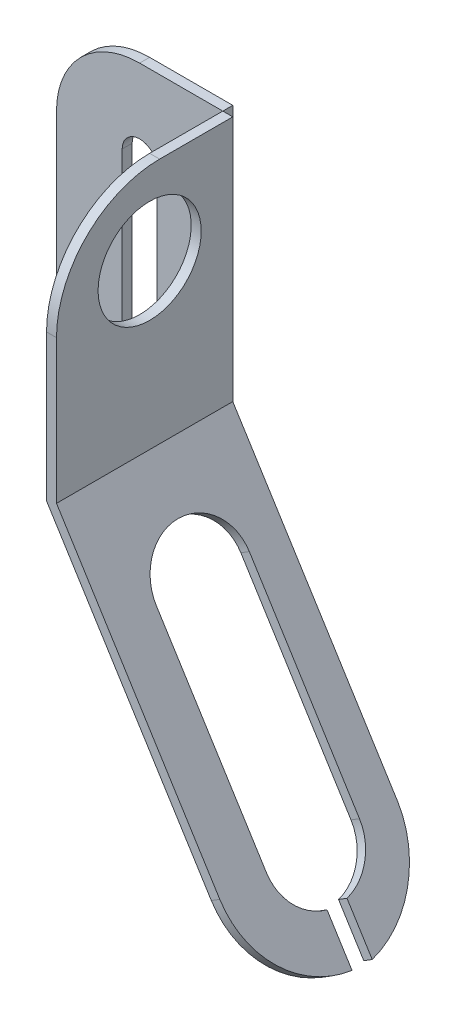
ISO-10303-21;
HEADER;
FILE_DESCRIPTION(('STEP AP214'),'2;1');
FILE_NAME('part.step','',(''),(''),'','','');
FILE_SCHEMA(('AUTOMOTIVE_DESIGN { 1 0 10303 214 1 1 1 1 }'));
ENDSEC;
DATA;
#1=APPLICATION_CONTEXT('core data for automotive mechanical design processes');
#2=APPLICATION_PROTOCOL_DEFINITION('international standard','automotive_design',2000,#1);
#3=PRODUCT_CONTEXT('',#1,'mechanical');
#4=PRODUCT('Part','Part','',(#3));
#5=PRODUCT_RELATED_PRODUCT_CATEGORY('part','',(#4));
#6=PRODUCT_DEFINITION_FORMATION('','',#4);
#7=PRODUCT_DEFINITION_CONTEXT('part definition',#1,'design');
#8=PRODUCT_DEFINITION('design','',#6,#7);
#9=PRODUCT_DEFINITION_SHAPE('','',#8);
#10=(LENGTH_UNIT() NAMED_UNIT(*) SI_UNIT(.MILLI.,.METRE.));
#11=(NAMED_UNIT(*) PLANE_ANGLE_UNIT() SI_UNIT($,.RADIAN.));
#12=(NAMED_UNIT(*) SI_UNIT($,.STERADIAN.) SOLID_ANGLE_UNIT());
#13=UNCERTAINTY_MEASURE_WITH_UNIT(LENGTH_MEASURE(1.E-05),#10,'distance_accuracy_value','');
#14=(GEOMETRIC_REPRESENTATION_CONTEXT(3) GLOBAL_UNCERTAINTY_ASSIGNED_CONTEXT((#13)) GLOBAL_UNIT_ASSIGNED_CONTEXT((#10,
#11,#12)) REPRESENTATION_CONTEXT('',''));
#15=CARTESIAN_POINT('',(0.,0.,0.));
#16=DIRECTION('',(0.,0.,1.));
#17=DIRECTION('',(1.,0.,0.));
#18=AXIS2_PLACEMENT_3D('',#15,#16,#17);
#19=CARTESIAN_POINT('',(0.,0.,1.06));
#20=DIRECTION('',(0.848048096156429,0.5299192642332,0.));
#21=DIRECTION('',(-0.5299192642332,0.848048096156429,0.));
#22=AXIS2_PLACEMENT_3D('',#19,#20,#21);
#23=PLANE('',#22);
#24=CARTESIAN_POINT('',(0.990949024116084,-1.58584993981252,0.5));
#25=DIRECTION('',(-0.848048096156429,-0.5299192642332,0.));
#26=DIRECTION('',(0.5299192642332,-0.848048096156429,0.));
#27=AXIS2_PLACEMENT_3D('',#24,#25,#26);
#28=CIRCLE('',#27,0.56);
#29=CARTESIAN_POINT('',(1.28599558357356,-2.05802313658708,0.56));
#30=VERTEX_POINT('',#29);
#31=CARTESIAN_POINT('',(0.990949024116084,-1.58584993981252,1.06));
#32=VERTEX_POINT('',#31);
#33=EDGE_CURVE('E222',#30,#32,#28,.T.);
#34=ORIENTED_EDGE('',*,*,#33,.T.);
#35=DIRECTION('',(0.5299192642332,-0.848048096156429,0.));
#36=VECTOR('',#35,1.);
#37=CARTESIAN_POINT('',(0.,0.,1.06));
#38=LINE('',#37,#36);
#39=CARTESIAN_POINT('',(0.,0.,1.06));
#40=VERTEX_POINT('',#39);
#41=EDGE_CURVE('E290',#40,#32,#38,.T.);
#42=ORIENTED_EDGE('',*,*,#41,.F.);
#43=DIRECTION('',(0.,0.,-1.));
#44=VECTOR('',#43,1.);
#45=CARTESIAN_POINT('',(0.,0.,1.06));
#46=LINE('',#45,#44);
#47=CARTESIAN_POINT('',(0.,0.,0.));
#48=VERTEX_POINT('',#47);
#49=EDGE_CURVE('E305',#40,#48,#46,.T.);
#50=ORIENTED_EDGE('',*,*,#49,.T.);
#51=DIRECTION('',(0.5299192642332,-0.848048096156429,0.));
#52=VECTOR('',#51,1.);
#53=CARTESIAN_POINT('',(0.,0.,0.));
#54=LINE('',#53,#52);
#55=CARTESIAN_POINT('',(1.00470071166607,-1.60785724023136,0.));
#56=VERTEX_POINT('',#55);
#57=EDGE_CURVE('E289',#48,#56,#54,.T.);
#58=ORIENTED_EDGE('',*,*,#57,.T.);
#59=CARTESIAN_POINT('',(0.997824867891083,-1.59685359002194,0.559849660582599));
#60=DIRECTION('',(-0.848048096156429,-0.5299192642332,0.));
#61=DIRECTION('',(0.5299192642332,-0.848048096156429,0.));
#62=AXIS2_PLACEMENT_3D('',#59,#60,#61);
#63=CIRCLE('',#62,0.56);
#64=CARTESIAN_POINT('',(1.28770381208668,-2.06075687366012,0.44));
#65=VERTEX_POINT('',#64);
#66=EDGE_CURVE('E103',#56,#65,#63,.T.);
#67=ORIENTED_EDGE('',*,*,#66,.T.);
#68=DIRECTION('',(0.5299192642332,-0.848048096156429,0.));
#69=VECTOR('',#68,1.);
#70=CARTESIAN_POINT('',(0.,0.,0.44));
#71=LINE('',#70,#69);
#72=CARTESIAN_POINT('',(1.13587976312644,-1.81778760577024,0.44));
#73=VERTEX_POINT('',#72);
#74=EDGE_CURVE('E199',#73,#65,#71,.T.);
#75=ORIENTED_EDGE('',*,*,#74,.F.);
#76=CARTESIAN_POINT('',(0.990949024116084,-1.58584993981252,0.5));
#77=DIRECTION('',(-0.848048096156429,-0.5299192642332,0.));
#78=DIRECTION('',(0.5299192642332,-0.848048096156429,0.));
#79=AXIS2_PLACEMENT_3D('',#76,#77,#78);
#80=CIRCLE('',#79,0.28);
#81=CARTESIAN_POINT('',(0.990949024116084,-1.58584993981252,0.22));
#82=VERTEX_POINT('',#81);
#83=EDGE_CURVE('E209',#82,#73,#80,.T.);
#84=ORIENTED_EDGE('',*,*,#83,.F.);
#85=DIRECTION('',(0.5299192642332,-0.848048096156429,0.));
#86=VECTOR('',#85,1.);
#87=CARTESIAN_POINT('',(0.,0.,0.22));
#88=LINE('',#87,#86);
#89=CARTESIAN_POINT('',(0.328549943824584,-0.525789819616986,0.22));
#90=VERTEX_POINT('',#89);
#91=EDGE_CURVE('E206',#90,#82,#88,.T.);
#92=ORIENTED_EDGE('',*,*,#91,.F.);
#93=CARTESIAN_POINT('',(0.328549943824584,-0.525789819616986,0.5));
#94=DIRECTION('',(-0.848048096156429,-0.5299192642332,0.));
#95=DIRECTION('',(0.5299192642332,-0.848048096156429,0.));
#96=AXIS2_PLACEMENT_3D('',#93,#94,#95);
#97=CIRCLE('',#96,0.28);
#98=CARTESIAN_POINT('',(0.328549943824584,-0.525789819616986,0.78));
#99=VERTEX_POINT('',#98);
#100=EDGE_CURVE('E235',#99,#90,#97,.T.);
#101=ORIENTED_EDGE('',*,*,#100,.F.);
#102=DIRECTION('',(0.5299192642332,-0.848048096156429,0.));
#103=VECTOR('',#102,1.);
#104=CARTESIAN_POINT('',(0.,0.,0.78));
#105=LINE('',#104,#103);
#106=CARTESIAN_POINT('',(0.990949024116084,-1.58584993981252,0.78));
#107=VERTEX_POINT('',#106);
#108=EDGE_CURVE('E231',#99,#107,#105,.T.);
#109=ORIENTED_EDGE('',*,*,#108,.T.);
#110=CARTESIAN_POINT('',(1.13587976312644,-1.81778760577024,0.56));
#111=VERTEX_POINT('',#110);
#112=EDGE_CURVE('E218',#111,#107,#80,.T.);
#113=ORIENTED_EDGE('',*,*,#112,.F.);
#114=DIRECTION('',(0.5299192642332,-0.848048096156429,0.));
#115=VECTOR('',#114,1.);
#116=CARTESIAN_POINT('',(0.,0.,0.559999999999999));
#117=LINE('',#116,#115);
#118=EDGE_CURVE('E225',#111,#30,#117,.T.);
#119=ORIENTED_EDGE('',*,*,#118,.T.);
#120=EDGE_LOOP('',(#34,#42,#50,#58,#67,#75,#84,#92,#101,#109,#113,#119));
#121=FACE_BOUND('',#120,.T.);
#122=ADVANCED_FACE('F88',(#121),#23,.F.);
#123=CARTESIAN_POINT('',(0.0508828857693857,0.031795155853992,1.06));
#124=DIRECTION('',(0.848048096156429,0.5299192642332,0.));
#125=DIRECTION('',(-0.5299192642332,0.848048096156429,0.));
#126=AXIS2_PLACEMENT_3D('',#123,#124,#125);
#127=PLANE('',#126);
#128=DIRECTION('',(0.5299192642332,-0.848048096156429,0.));
#129=VECTOR('',#128,1.);
#130=CARTESIAN_POINT('',(0.0508828857693857,0.031795155853992,1.06));
#131=LINE('',#130,#129);
#132=CARTESIAN_POINT('',(0.06,0.0172047231455283,1.06));
#133=VERTEX_POINT('',#132);
#134=CARTESIAN_POINT('',(1.04183190988547,-1.55405478395853,1.06));
#135=VERTEX_POINT('',#134);
#136=EDGE_CURVE('E294',#133,#135,#131,.T.);
#137=ORIENTED_EDGE('',*,*,#136,.T.);
#138=CARTESIAN_POINT('',(1.04183190988547,-1.55405478395853,0.5));
#139=DIRECTION('',(0.848048096156429,0.5299192642332,0.));
#140=DIRECTION('',(-0.5299192642332,0.848048096156429,0.));
#141=AXIS2_PLACEMENT_3D('',#138,#139,#140);
#142=CIRCLE('',#141,0.56);
#143=CARTESIAN_POINT('',(1.33687846934294,-2.02622798073309,0.56));
#144=VERTEX_POINT('',#143);
#145=EDGE_CURVE('E259',#135,#144,#142,.T.);
#146=ORIENTED_EDGE('',*,*,#145,.T.);
#147=DIRECTION('',(-0.5299192642332,0.848048096156429,0.));
#148=VECTOR('',#147,1.);
#149=CARTESIAN_POINT('',(0.0508828857693858,0.0317951558539918,0.559999999999999));
#150=LINE('',#149,#148);
#151=CARTESIAN_POINT('',(1.18676264889583,-1.78599244991624,0.56));
#152=VERTEX_POINT('',#151);
#153=EDGE_CURVE('E13',#144,#152,#150,.T.);
#154=ORIENTED_EDGE('',*,*,#153,.T.);
#155=CARTESIAN_POINT('',(1.04183190988547,-1.55405478395853,0.5));
#156=DIRECTION('',(0.848048096156429,0.5299192642332,0.));
#157=DIRECTION('',(-0.5299192642332,0.848048096156429,0.));
#158=AXIS2_PLACEMENT_3D('',#155,#156,#157);
#159=CIRCLE('',#158,0.28);
#160=CARTESIAN_POINT('',(1.04183190988547,-1.55405478395853,0.78));
#161=VERTEX_POINT('',#160);
#162=EDGE_CURVE('E96',#161,#152,#159,.T.);
#163=ORIENTED_EDGE('',*,*,#162,.F.);
#164=DIRECTION('',(-0.5299192642332,0.848048096156429,0.));
#165=VECTOR('',#164,1.);
#166=CARTESIAN_POINT('',(0.0508828857693857,0.031795155853992,0.78));
#167=LINE('',#166,#165);
#168=CARTESIAN_POINT('',(0.37943282959397,-0.493994663762994,0.78));
#169=VERTEX_POINT('',#168);
#170=EDGE_CURVE('E352',#161,#169,#167,.T.);
#171=ORIENTED_EDGE('',*,*,#170,.T.);
#172=CARTESIAN_POINT('',(0.37943282959397,-0.493994663762994,0.5));
#173=DIRECTION('',(0.848048096156429,0.5299192642332,0.));
#174=DIRECTION('',(-0.5299192642332,0.848048096156429,0.));
#175=AXIS2_PLACEMENT_3D('',#172,#173,#174);
#176=CIRCLE('',#175,0.28);
#177=CARTESIAN_POINT('',(0.37943282959397,-0.493994663762994,0.22));
#178=VERTEX_POINT('',#177);
#179=EDGE_CURVE('E349',#178,#169,#176,.T.);
#180=ORIENTED_EDGE('',*,*,#179,.F.);
#181=DIRECTION('',(-0.5299192642332,0.848048096156429,0.));
#182=VECTOR('',#181,1.);
#183=CARTESIAN_POINT('',(0.0508828857693859,0.0317951558539918,0.22));
#184=LINE('',#183,#182);
#185=CARTESIAN_POINT('',(1.04183190988547,-1.55405478395853,0.22));
#186=VERTEX_POINT('',#185);
#187=EDGE_CURVE('E346',#186,#178,#184,.T.);
#188=ORIENTED_EDGE('',*,*,#187,.F.);
#189=CARTESIAN_POINT('',(1.04183190988547,-1.55405478395853,0.5));
#190=DIRECTION('',(0.848048096156429,0.5299192642332,0.));
#191=DIRECTION('',(-0.5299192642332,0.848048096156429,0.));
#192=AXIS2_PLACEMENT_3D('',#189,#190,#191);
#193=CIRCLE('',#192,0.28);
#194=CARTESIAN_POINT('',(1.18676264889583,-1.78599244991624,0.44));
#195=VERTEX_POINT('',#194);
#196=EDGE_CURVE('E343',#195,#186,#193,.T.);
#197=ORIENTED_EDGE('',*,*,#196,.F.);
#198=DIRECTION('',(-0.5299192642332,0.848048096156429,0.));
#199=VECTOR('',#198,1.);
#200=CARTESIAN_POINT('',(0.0508828857693858,0.0317951558539919,0.44));
#201=LINE('',#200,#199);
#202=CARTESIAN_POINT('',(1.33858669785606,-2.02896171780613,0.44));
#203=VERTEX_POINT('',#202);
#204=EDGE_CURVE('E201',#203,#195,#201,.T.);
#205=ORIENTED_EDGE('',*,*,#204,.F.);
#206=CARTESIAN_POINT('',(1.04870775366047,-1.56505843416795,0.559849660582599));
#207=DIRECTION('',(0.848048096156429,0.5299192642332,0.));
#208=DIRECTION('',(-0.5299192642332,0.848048096156429,0.));
#209=AXIS2_PLACEMENT_3D('',#206,#207,#208);
#210=CIRCLE('',#209,0.56);
#211=CARTESIAN_POINT('',(1.05558359743546,-1.57606208437736,0.));
#212=VERTEX_POINT('',#211);
#213=EDGE_CURVE('E268',#203,#212,#210,.T.);
#214=ORIENTED_EDGE('',*,*,#213,.T.);
#215=DIRECTION('',(0.5299192642332,-0.848048096156429,0.));
#216=VECTOR('',#215,1.);
#217=CARTESIAN_POINT('',(0.0508828857693857,0.031795155853992,0.));
#218=LINE('',#217,#216);
#219=CARTESIAN_POINT('',(0.06,0.0172047231455283,0.));
#220=VERTEX_POINT('',#219);
#221=EDGE_CURVE('E308',#220,#212,#218,.T.);
#222=ORIENTED_EDGE('',*,*,#221,.F.);
#223=DIRECTION('',(0.,0.,-1.));
#224=VECTOR('',#223,1.);
#225=CARTESIAN_POINT('',(0.06,0.0172047231455283,1.06));
#226=LINE('',#225,#224);
#227=EDGE_CURVE('E331',#133,#220,#226,.T.);
#228=ORIENTED_EDGE('',*,*,#227,.F.);
#229=EDGE_LOOP('',(#137,#146,#154,#163,#171,#180,#188,#197,#205,#214,#222,#228));
#230=FACE_BOUND('',#229,.T.);
#231=ADVANCED_FACE('F368',(#230),#127,.T.);
#232=CARTESIAN_POINT('',(0.,0.,1.06));
#233=DIRECTION('',(0.,0.,-1.));
#234=DIRECTION('',(-1.,0.,0.));
#235=AXIS2_PLACEMENT_3D('',#232,#233,#234);
#236=PLANE('',#235);
#237=DIRECTION('',(-0.848048096156429,-0.5299192642332,0.));
#238=VECTOR('',#237,1.);
#239=CARTESIAN_POINT('',(1.8898800060419,-1.02413551972533,1.06));
#240=LINE('',#239,#238);
#241=EDGE_CURVE('E340',#135,#32,#240,.T.);
#242=ORIENTED_EDGE('',*,*,#241,.F.);
#243=ORIENTED_EDGE('',*,*,#136,.F.);
#244=DIRECTION('',(0.,1.,0.));
#245=VECTOR('',#244,1.);
#246=CARTESIAN_POINT('',(0.06,0.,1.06));
#247=LINE('',#246,#245);
#248=CARTESIAN_POINT('',(0.0599999999999999,0.879999999999996,1.06));
#249=VERTEX_POINT('',#248);
#250=EDGE_CURVE('E299',#249,#133,#247,.F.);
#251=ORIENTED_EDGE('',*,*,#250,.F.);
#252=DIRECTION('',(-1.,0.,0.));
#253=VECTOR('',#252,1.);
#254=CARTESIAN_POINT('',(1.33858669785606,0.88,1.06));
#255=LINE('',#254,#253);
#256=CARTESIAN_POINT('',(0.,0.879999999999996,1.06));
#257=VERTEX_POINT('',#256);
#258=EDGE_CURVE('E334',#249,#257,#255,.T.);
#259=ORIENTED_EDGE('',*,*,#258,.T.);
#260=DIRECTION('',(0.,-1.,0.));
#261=VECTOR('',#260,1.);
#262=CARTESIAN_POINT('',(0.,0.,1.06));
#263=LINE('',#262,#261);
#264=EDGE_CURVE('E302',#257,#40,#263,.T.);
#265=ORIENTED_EDGE('',*,*,#264,.T.);
#266=ORIENTED_EDGE('',*,*,#41,.T.);
#267=EDGE_LOOP('',(#242,#243,#251,#259,#265,#266));
#268=FACE_BOUND('',#267,.T.);
#269=ADVANCED_FACE('F376',(#268),#236,.F.);
#270=CARTESIAN_POINT('',(0.,0.,0.));
#271=DIRECTION('',(0.,0.,-1.));
#272=DIRECTION('',(-1.,0.,0.));
#273=AXIS2_PLACEMENT_3D('',#270,#271,#272);
#274=PLANE('',#273);
#275=ORIENTED_EDGE('',*,*,#221,.T.);
#276=DIRECTION('',(-0.848048096156429,-0.5299192642332,0.));
#277=VECTOR('',#276,1.);
#278=CARTESIAN_POINT('',(1.90363169359189,-1.04614282014416,0.));
#279=LINE('',#278,#277);
#280=EDGE_CURVE('E337',#212,#56,#279,.T.);
#281=ORIENTED_EDGE('',*,*,#280,.T.);
#282=ORIENTED_EDGE('',*,*,#57,.F.);
#283=DIRECTION('',(0.,-1.,0.));
#284=VECTOR('',#283,1.);
#285=CARTESIAN_POINT('',(0.,0.,0.));
#286=LINE('',#285,#284);
#287=CARTESIAN_POINT('',(0.,1.5,0.));
#288=VERTEX_POINT('',#287);
#289=EDGE_CURVE('E295',#288,#48,#286,.T.);
#290=ORIENTED_EDGE('',*,*,#289,.F.);
#291=DIRECTION('',(1.,0.,0.));
#292=VECTOR('',#291,1.);
#293=CARTESIAN_POINT('',(0.,1.5,0.));
#294=LINE('',#293,#292);
#295=CARTESIAN_POINT('',(0.06,1.5,0.));
#296=VERTEX_POINT('',#295);
#297=EDGE_CURVE('E316',#288,#296,#294,.T.);
#298=ORIENTED_EDGE('',*,*,#297,.T.);
#299=DIRECTION('',(0.,1.,0.));
#300=VECTOR('',#299,1.);
#301=CARTESIAN_POINT('',(0.06,0.,0.));
#302=LINE('',#301,#300);
#303=EDGE_CURVE('E312',#296,#220,#302,.F.);
#304=ORIENTED_EDGE('',*,*,#303,.T.);
#305=EDGE_LOOP('',(#275,#281,#282,#290,#298,#304));
#306=FACE_BOUND('',#305,.T.);
#307=ADVANCED_FACE('F411',(#306),#274,.T.);
#308=CARTESIAN_POINT('',(0.06,0.,1.06));
#309=DIRECTION('',(1.,0.,0.));
#310=DIRECTION('',(0.,0.,-1.));
#311=AXIS2_PLACEMENT_3D('',#308,#309,#310);
#312=PLANE('',#311);
#313=CARTESIAN_POINT('',(0.0599999999999999,1.,0.5));
#314=DIRECTION('',(1.,0.,0.));
#315=DIRECTION('',(0.,0.,-1.));
#316=AXIS2_PLACEMENT_3D('',#313,#314,#315);
#317=CIRCLE('',#316,0.31);
#318=CARTESIAN_POINT('',(0.0599999999999999,1.,0.19));
#319=VERTEX_POINT('',#318);
#320=EDGE_CURVE('E285',#319,#319,#317,.T.);
#321=ORIENTED_EDGE('',*,*,#320,.F.);
#322=EDGE_LOOP('',(#321));
#323=FACE_BOUND('',#322,.T.);
#324=DIRECTION('',(0.,0.,-1.));
#325=VECTOR('',#324,1.);
#326=CARTESIAN_POINT('',(0.06,1.5,1.06));
#327=LINE('',#326,#325);
#328=CARTESIAN_POINT('',(0.0599999999999999,1.5,0.439999999999996));
#329=VERTEX_POINT('',#328);
#330=EDGE_CURVE('E328',#329,#296,#327,.T.);
#331=ORIENTED_EDGE('',*,*,#330,.F.);
#332=CARTESIAN_POINT('',(0.0599999999999999,0.88,0.44));
#333=DIRECTION('',(1.,0.,0.));
#334=DIRECTION('',(0.,0.,-1.));
#335=AXIS2_PLACEMENT_3D('',#332,#333,#334);
#336=CIRCLE('',#335,0.62);
#337=EDGE_CURVE('E277',#329,#249,#336,.T.);
#338=ORIENTED_EDGE('',*,*,#337,.T.);
#339=ORIENTED_EDGE('',*,*,#250,.T.);
#340=ORIENTED_EDGE('',*,*,#227,.T.);
#341=ORIENTED_EDGE('',*,*,#303,.F.);
#342=EDGE_LOOP('',(#331,#338,#339,#340,#341));
#343=FACE_BOUND('',#342,.T.);
#344=ADVANCED_FACE('F414',(#323,#343),#312,.T.);
#345=CARTESIAN_POINT('',(0.,0.,1.06));
#346=DIRECTION('',(1.,0.,0.));
#347=DIRECTION('',(0.,0.,-1.));
#348=AXIS2_PLACEMENT_3D('',#345,#346,#347);
#349=PLANE('',#348);
#350=CARTESIAN_POINT('',(0.,1.,0.5));
#351=DIRECTION('',(-1.,0.,0.));
#352=DIRECTION('',(0.,0.,1.));
#353=AXIS2_PLACEMENT_3D('',#350,#351,#352);
#354=CIRCLE('',#353,0.31);
#355=CARTESIAN_POINT('',(0.,1.,0.81));
#356=VERTEX_POINT('',#355);
#357=EDGE_CURVE('E281',#356,#356,#354,.T.);
#358=ORIENTED_EDGE('',*,*,#357,.F.);
#359=EDGE_LOOP('',(#358));
#360=FACE_BOUND('',#359,.T.);
#361=CARTESIAN_POINT('',(0.,0.88,0.44));
#362=DIRECTION('',(-1.,0.,0.));
#363=DIRECTION('',(0.,0.,1.));
#364=AXIS2_PLACEMENT_3D('',#361,#362,#363);
#365=CIRCLE('',#364,0.62);
#366=CARTESIAN_POINT('',(0.,1.5,0.439999999999996));
#367=VERTEX_POINT('',#366);
#368=EDGE_CURVE('E111',#257,#367,#365,.T.);
#369=ORIENTED_EDGE('',*,*,#368,.T.);
#370=DIRECTION('',(0.,0.,-1.));
#371=VECTOR('',#370,1.);
#372=CARTESIAN_POINT('',(0.,1.5,1.06));
#373=LINE('',#372,#371);
#374=EDGE_CURVE('E325',#367,#288,#373,.T.);
#375=ORIENTED_EDGE('',*,*,#374,.T.);
#376=ORIENTED_EDGE('',*,*,#289,.T.);
#377=ORIENTED_EDGE('',*,*,#49,.F.);
#378=ORIENTED_EDGE('',*,*,#264,.F.);
#379=EDGE_LOOP('',(#369,#375,#376,#377,#378));
#380=FACE_BOUND('',#379,.T.);
#381=ADVANCED_FACE('F417',(#360,#380),#349,.F.);
#382=CARTESIAN_POINT('',(0.,1.5,1.06));
#383=DIRECTION('',(0.,1.,0.));
#384=DIRECTION('',(0.,0.,1.));
#385=AXIS2_PLACEMENT_3D('',#382,#383,#384);
#386=PLANE('',#385);
#387=DIRECTION('',(-1.,0.,0.));
#388=VECTOR('',#387,1.);
#389=CARTESIAN_POINT('',(1.33858669785606,1.5,0.439999999999996));
#390=LINE('',#389,#388);
#391=EDGE_CURVE('E274',#329,#367,#390,.T.);
#392=ORIENTED_EDGE('',*,*,#391,.F.);
#393=ORIENTED_EDGE('',*,*,#330,.T.);
#394=ORIENTED_EDGE('',*,*,#297,.F.);
#395=ORIENTED_EDGE('',*,*,#374,.F.);
#396=EDGE_LOOP('',(#392,#393,#394,#395));
#397=FACE_BOUND('',#396,.T.);
#398=ADVANCED_FACE('F419',(#397),#386,.T.);
#399=CARTESIAN_POINT('',(1.33858669785606,1.,0.5));
#400=DIRECTION('',(-1.,0.,0.));
#401=DIRECTION('',(0.,0.,1.));
#402=AXIS2_PLACEMENT_3D('',#399,#400,#401);
#403=CYLINDRICAL_SURFACE('',#402,0.31);
#404=ORIENTED_EDGE('',*,*,#320,.T.);
#405=EDGE_LOOP('',(#404));
#406=FACE_BOUND('',#405,.T.);
#407=ORIENTED_EDGE('',*,*,#357,.T.);
#408=EDGE_LOOP('',(#407));
#409=FACE_BOUND('',#408,.T.);
#410=ADVANCED_FACE('F422',(#406,#409),#403,.F.);
#411=CARTESIAN_POINT('',(1.33858669785606,0.88,0.44));
#412=DIRECTION('',(-1.,0.,0.));
#413=DIRECTION('',(0.,0.,1.));
#414=AXIS2_PLACEMENT_3D('',#411,#412,#413);
#415=CYLINDRICAL_SURFACE('',#414,0.62);
#416=ORIENTED_EDGE('',*,*,#391,.T.);
#417=ORIENTED_EDGE('',*,*,#368,.F.);
#418=ORIENTED_EDGE('',*,*,#258,.F.);
#419=ORIENTED_EDGE('',*,*,#337,.F.);
#420=EDGE_LOOP('',(#416,#417,#418,#419));
#421=FACE_BOUND('',#420,.T.);
#422=ADVANCED_FACE('F432',(#421),#415,.T.);
#423=CARTESIAN_POINT('',(1.8967558498169,-1.03513916993475,0.559849660582599));
#424=DIRECTION('',(-0.848048096156429,-0.5299192642332,0.));
#425=DIRECTION('',(0.5299192642332,-0.848048096156429,0.));
#426=AXIS2_PLACEMENT_3D('',#423,#424,#425);
#427=CYLINDRICAL_SURFACE('',#426,0.56);
#428=DIRECTION('',(-0.848048096156429,-0.5299192642332,0.));
#429=VECTOR('',#428,1.);
#430=CARTESIAN_POINT('',(2.18663479401249,-1.49904245357293,0.44));
#431=LINE('',#430,#429);
#432=EDGE_CURVE('E265',#203,#65,#431,.T.);
#433=ORIENTED_EDGE('',*,*,#432,.T.);
#434=ORIENTED_EDGE('',*,*,#66,.F.);
#435=ORIENTED_EDGE('',*,*,#280,.F.);
#436=ORIENTED_EDGE('',*,*,#213,.F.);
#437=EDGE_LOOP('',(#433,#434,#435,#436));
#438=FACE_BOUND('',#437,.T.);
#439=ADVANCED_FACE('F402',(#438),#427,.T.);
#440=CARTESIAN_POINT('',(1.8898800060419,-1.02413551972533,0.5));
#441=DIRECTION('',(-0.848048096156429,-0.5299192642332,0.));
#442=DIRECTION('',(0.5299192642332,-0.848048096156429,0.));
#443=AXIS2_PLACEMENT_3D('',#440,#441,#442);
#444=CYLINDRICAL_SURFACE('',#443,0.28);
#445=ORIENTED_EDGE('',*,*,#196,.T.);
#446=DIRECTION('',(-0.848048096156429,-0.5299192642332,0.));
#447=VECTOR('',#446,1.);
#448=CARTESIAN_POINT('',(1.8898800060419,-1.02413551972533,0.22));
#449=LINE('',#448,#447);
#450=EDGE_CURVE('E212',#186,#82,#449,.T.);
#451=ORIENTED_EDGE('',*,*,#450,.T.);
#452=ORIENTED_EDGE('',*,*,#83,.T.);
#453=DIRECTION('',(-0.848048096156429,-0.5299192642332,0.));
#454=VECTOR('',#453,1.);
#455=CARTESIAN_POINT('',(2.03481074505226,-1.25607318568304,0.44));
#456=LINE('',#455,#454);
#457=EDGE_CURVE('E195',#195,#73,#456,.T.);
#458=ORIENTED_EDGE('',*,*,#457,.F.);
#459=EDGE_LOOP('',(#445,#451,#452,#458));
#460=FACE_BOUND('',#459,.T.);
#461=ADVANCED_FACE('F210',(#460),#444,.F.);
#462=CARTESIAN_POINT('',(0.898930981925815,0.561714420087192,0.22));
#463=DIRECTION('',(0.,0.,-1.));
#464=DIRECTION('',(0.,1.,0.));
#465=AXIS2_PLACEMENT_3D('',#462,#463,#464);
#466=PLANE('',#465);
#467=ORIENTED_EDGE('',*,*,#187,.T.);
#468=DIRECTION('',(-0.848048096156429,-0.5299192642332,0.));
#469=VECTOR('',#468,1.);
#470=CARTESIAN_POINT('',(1.2274809257504,0.035924600470206,0.22));
#471=LINE('',#470,#469);
#472=EDGE_CURVE('E243',#178,#90,#471,.T.);
#473=ORIENTED_EDGE('',*,*,#472,.T.);
#474=ORIENTED_EDGE('',*,*,#91,.T.);
#475=ORIENTED_EDGE('',*,*,#450,.F.);
#476=EDGE_LOOP('',(#467,#473,#474,#475));
#477=FACE_BOUND('',#476,.T.);
#478=ADVANCED_FACE('F394',(#477),#466,.F.);
#479=CARTESIAN_POINT('',(1.2274809257504,0.035924600470206,0.5));
#480=DIRECTION('',(-0.848048096156429,-0.5299192642332,0.));
#481=DIRECTION('',(0.5299192642332,-0.848048096156429,0.));
#482=AXIS2_PLACEMENT_3D('',#479,#480,#481);
#483=CYLINDRICAL_SURFACE('',#482,0.28);
#484=ORIENTED_EDGE('',*,*,#179,.T.);
#485=DIRECTION('',(-0.848048096156429,-0.5299192642332,0.));
#486=VECTOR('',#485,1.);
#487=CARTESIAN_POINT('',(1.2274809257504,0.035924600470206,0.78));
#488=LINE('',#487,#486);
#489=EDGE_CURVE('E246',#169,#99,#488,.T.);
#490=ORIENTED_EDGE('',*,*,#489,.T.);
#491=ORIENTED_EDGE('',*,*,#100,.T.);
#492=ORIENTED_EDGE('',*,*,#472,.F.);
#493=EDGE_LOOP('',(#484,#490,#491,#492));
#494=FACE_BOUND('',#493,.T.);
#495=ADVANCED_FACE('F392',(#494),#483,.F.);
#496=CARTESIAN_POINT('',(0.898930981925815,0.561714420087192,0.78));
#497=DIRECTION('',(0.,0.,-1.));
#498=DIRECTION('',(-1.,0.,0.));
#499=AXIS2_PLACEMENT_3D('',#496,#497,#498);
#500=PLANE('',#499);
#501=DIRECTION('',(-0.848048096156429,-0.5299192642332,0.));
#502=VECTOR('',#501,1.);
#503=CARTESIAN_POINT('',(1.8898800060419,-1.02413551972533,0.78));
#504=LINE('',#503,#502);
#505=EDGE_CURVE('E249',#161,#107,#504,.T.);
#506=ORIENTED_EDGE('',*,*,#505,.T.);
#507=ORIENTED_EDGE('',*,*,#108,.F.);
#508=ORIENTED_EDGE('',*,*,#489,.F.);
#509=ORIENTED_EDGE('',*,*,#170,.F.);
#510=EDGE_LOOP('',(#506,#507,#508,#509));
#511=FACE_BOUND('',#510,.T.);
#512=ADVANCED_FACE('F387',(#511),#500,.T.);
#513=ORIENTED_EDGE('',*,*,#162,.T.);
#514=DIRECTION('',(-0.848048096156429,-0.5299192642332,0.));
#515=VECTOR('',#514,1.);
#516=CARTESIAN_POINT('',(2.03481074505226,-1.25607318568304,0.56));
#517=LINE('',#516,#515);
#518=EDGE_CURVE('E252',#152,#111,#517,.T.);
#519=ORIENTED_EDGE('',*,*,#518,.T.);
#520=ORIENTED_EDGE('',*,*,#112,.T.);
#521=ORIENTED_EDGE('',*,*,#505,.F.);
#522=EDGE_LOOP('',(#513,#519,#520,#521));
#523=FACE_BOUND('',#522,.T.);
#524=ADVANCED_FACE('F360',(#523),#444,.F.);
#525=CARTESIAN_POINT('',(0.898930981925815,0.561714420087192,0.559999999999999));
#526=DIRECTION('',(0.,0.,-1.));
#527=DIRECTION('',(0.,1.,0.));
#528=AXIS2_PLACEMENT_3D('',#525,#526,#527);
#529=PLANE('',#528);
#530=DIRECTION('',(-0.848048096156429,-0.5299192642332,0.));
#531=VECTOR('',#530,1.);
#532=CARTESIAN_POINT('',(2.18492656549937,-1.49630871649989,0.56));
#533=LINE('',#532,#531);
#534=EDGE_CURVE('E205',#144,#30,#533,.T.);
#535=ORIENTED_EDGE('',*,*,#534,.T.);
#536=ORIENTED_EDGE('',*,*,#118,.F.);
#537=ORIENTED_EDGE('',*,*,#518,.F.);
#538=ORIENTED_EDGE('',*,*,#153,.F.);
#539=EDGE_LOOP('',(#535,#536,#537,#538));
#540=FACE_BOUND('',#539,.T.);
#541=ADVANCED_FACE('F365',(#540),#529,.T.);
#542=CARTESIAN_POINT('',(1.8898800060419,-1.02413551972533,0.5));
#543=DIRECTION('',(-0.848048096156429,-0.5299192642332,0.));
#544=DIRECTION('',(0.5299192642332,-0.848048096156429,0.));
#545=AXIS2_PLACEMENT_3D('',#542,#543,#544);
#546=CYLINDRICAL_SURFACE('',#545,0.56);
#547=ORIENTED_EDGE('',*,*,#241,.T.);
#548=ORIENTED_EDGE('',*,*,#33,.F.);
#549=ORIENTED_EDGE('',*,*,#534,.F.);
#550=ORIENTED_EDGE('',*,*,#145,.F.);
#551=EDGE_LOOP('',(#547,#548,#549,#550));
#552=FACE_BOUND('',#551,.T.);
#553=ADVANCED_FACE('F373',(#552),#546,.T.);
#554=CARTESIAN_POINT('',(0.898930981925815,0.561714420087192,0.44));
#555=DIRECTION('',(0.,0.,-1.));
#556=DIRECTION('',(0.,1.,0.));
#557=AXIS2_PLACEMENT_3D('',#554,#555,#556);
#558=PLANE('',#557);
#559=ORIENTED_EDGE('',*,*,#204,.T.);
#560=ORIENTED_EDGE('',*,*,#457,.T.);
#561=ORIENTED_EDGE('',*,*,#74,.T.);
#562=ORIENTED_EDGE('',*,*,#432,.F.);
#563=EDGE_LOOP('',(#559,#560,#561,#562));
#564=FACE_BOUND('',#563,.T.);
#565=ADVANCED_FACE('F197',(#564),#558,.F.);
#566=CLOSED_SHELL('',(#122,#231,#269,#307,#344,#381,#398,#410,#422,#439,#461,#478,#495,#512,
#524,#541,#553,#565));
#567=MANIFOLD_SOLID_BREP('B2',#566);
#568=CARTESIAN_POINT('',(-0.395,0.,-0.06));
#569=DIRECTION('',(0.,-1.,0.));
#570=DIRECTION('',(0.,0.,-1.));
#571=AXIS2_PLACEMENT_3D('',#568,#569,#570);
#572=PLANE('',#571);
#573=DIRECTION('',(1.,0.,0.));
#574=VECTOR('',#573,1.);
#575=CARTESIAN_POINT('',(-0.395,0.,0.));
#576=LINE('',#575,#574);
#577=CARTESIAN_POINT('',(-0.395,0.,0.));
#578=VERTEX_POINT('',#577);
#579=CARTESIAN_POINT('',(0.,0.,0.));
#580=VERTEX_POINT('',#579);
#581=EDGE_CURVE('E667',#578,#580,#576,.T.);
#582=ORIENTED_EDGE('',*,*,#581,.F.);
#583=DIRECTION('',(0.,0.,1.));
#584=VECTOR('',#583,1.);
#585=CARTESIAN_POINT('',(-0.395,0.,-0.06));
#586=LINE('',#585,#584);
#587=CARTESIAN_POINT('',(-0.395,0.,-0.06));
#588=VERTEX_POINT('',#587);
#589=EDGE_CURVE('E86',#588,#578,#586,.T.);
#590=ORIENTED_EDGE('',*,*,#589,.F.);
#591=DIRECTION('',(1.,0.,0.));
#592=VECTOR('',#591,1.);
#593=CARTESIAN_POINT('',(-0.395,0.,-0.06));
#594=LINE('',#593,#592);
#595=CARTESIAN_POINT('',(0.,0.,-0.06));
#596=VERTEX_POINT('',#595);
#597=EDGE_CURVE('E690',#588,#596,#594,.T.);
#598=ORIENTED_EDGE('',*,*,#597,.T.);
#599=DIRECTION('',(0.,0.,1.));
#600=VECTOR('',#599,1.);
#601=CARTESIAN_POINT('',(0.,0.,-0.06));
#602=LINE('',#601,#600);
#603=EDGE_CURVE('E567',#596,#580,#602,.T.);
#604=ORIENTED_EDGE('',*,*,#603,.T.);
#605=EDGE_LOOP('',(#582,#590,#598,#604));
#606=FACE_BOUND('',#605,.T.);
#607=ADVANCED_FACE('F564',(#606),#572,.T.);
#608=CARTESIAN_POINT('',(-0.395,1.,-0.06));
#609=DIRECTION('',(-1.,0.,0.));
#610=DIRECTION('',(0.,-1.,0.));
#611=AXIS2_PLACEMENT_3D('',#608,#609,#610);
#612=PLANE('',#611);
#613=DIRECTION('',(0.,-1.,0.));
#614=VECTOR('',#613,1.);
#615=CARTESIAN_POINT('',(-0.395,1.,0.));
#616=LINE('',#615,#614);
#617=CARTESIAN_POINT('',(-0.395,1.,0.));
#618=VERTEX_POINT('',#617);
#619=EDGE_CURVE('E688',#618,#578,#616,.T.);
#620=ORIENTED_EDGE('',*,*,#619,.F.);
#621=DIRECTION('',(0.,0.,1.));
#622=VECTOR('',#621,1.);
#623=CARTESIAN_POINT('',(-0.395,1.,-0.06));
#624=LINE('',#623,#622);
#625=CARTESIAN_POINT('',(-0.395,1.,-0.06));
#626=VERTEX_POINT('',#625);
#627=EDGE_CURVE('E573',#626,#618,#624,.T.);
#628=ORIENTED_EDGE('',*,*,#627,.F.);
#629=DIRECTION('',(0.,-1.,0.));
#630=VECTOR('',#629,1.);
#631=CARTESIAN_POINT('',(-0.395,1.,-0.06));
#632=LINE('',#631,#630);
#633=EDGE_CURVE('E657',#626,#588,#632,.T.);
#634=ORIENTED_EDGE('',*,*,#633,.T.);
#635=ORIENTED_EDGE('',*,*,#589,.T.);
#636=EDGE_LOOP('',(#620,#628,#634,#635));
#637=FACE_BOUND('',#636,.T.);
#638=ADVANCED_FACE('F704',(#637),#612,.T.);
#639=CARTESIAN_POINT('',(-0.5,1.,-0.06));
#640=DIRECTION('',(0.,0.,1.));
#641=DIRECTION('',(1.,0.,0.));
#642=AXIS2_PLACEMENT_3D('',#639,#640,#641);
#643=CYLINDRICAL_SURFACE('',#642,0.105);
#644=CARTESIAN_POINT('',(-0.5,1.,0.));
#645=DIRECTION('',(0.,0.,-1.));
#646=DIRECTION('',(1.,0.,0.));
#647=AXIS2_PLACEMENT_3D('',#644,#645,#646);
#648=CIRCLE('',#647,0.105);
#649=CARTESIAN_POINT('',(-0.605,1.,0.));
#650=VERTEX_POINT('',#649);
#651=EDGE_CURVE('E644',#650,#618,#648,.T.);
#652=ORIENTED_EDGE('',*,*,#651,.F.);
#653=DIRECTION('',(0.,0.,1.));
#654=VECTOR('',#653,1.);
#655=CARTESIAN_POINT('',(-0.605,1.,-0.06));
#656=LINE('',#655,#654);
#657=CARTESIAN_POINT('',(-0.605,1.,-0.06));
#658=VERTEX_POINT('',#657);
#659=EDGE_CURVE('E639',#658,#650,#656,.T.);
#660=ORIENTED_EDGE('',*,*,#659,.F.);
#661=CARTESIAN_POINT('',(-0.5,1.,-0.06));
#662=DIRECTION('',(0.,0.,-1.));
#663=DIRECTION('',(1.,0.,0.));
#664=AXIS2_PLACEMENT_3D('',#661,#662,#663);
#665=CIRCLE('',#664,0.105);
#666=EDGE_CURVE('E642',#658,#626,#665,.T.);
#667=ORIENTED_EDGE('',*,*,#666,.T.);
#668=ORIENTED_EDGE('',*,*,#627,.T.);
#669=EDGE_LOOP('',(#652,#660,#667,#668));
#670=FACE_BOUND('',#669,.T.);
#671=ADVANCED_FACE('F641',(#670),#643,.F.);
#672=CARTESIAN_POINT('',(-0.605,1.,-0.06));
#673=DIRECTION('',(1.,0.,0.));
#674=DIRECTION('',(0.,0.,-1.));
#675=AXIS2_PLACEMENT_3D('',#672,#673,#674);
#676=PLANE('',#675);
#677=DIRECTION('',(0.,1.,0.));
#678=VECTOR('',#677,1.);
#679=CARTESIAN_POINT('',(-0.605,1.,0.));
#680=LINE('',#679,#678);
#681=CARTESIAN_POINT('',(-0.605,0.,0.));
#682=VERTEX_POINT('',#681);
#683=EDGE_CURVE('E685',#682,#650,#680,.T.);
#684=ORIENTED_EDGE('',*,*,#683,.F.);
#685=DIRECTION('',(0.,0.,1.));
#686=VECTOR('',#685,1.);
#687=CARTESIAN_POINT('',(-0.605,0.,-0.06));
#688=LINE('',#687,#686);
#689=CARTESIAN_POINT('',(-0.605,0.,-0.06));
#690=VERTEX_POINT('',#689);
#691=EDGE_CURVE('E649',#690,#682,#688,.T.);
#692=ORIENTED_EDGE('',*,*,#691,.F.);
#693=DIRECTION('',(0.,1.,0.));
#694=VECTOR('',#693,1.);
#695=CARTESIAN_POINT('',(-0.605,1.,-0.06));
#696=LINE('',#695,#694);
#697=EDGE_CURVE('E655',#690,#658,#696,.T.);
#698=ORIENTED_EDGE('',*,*,#697,.T.);
#699=ORIENTED_EDGE('',*,*,#659,.T.);
#700=EDGE_LOOP('',(#684,#692,#698,#699));
#701=FACE_BOUND('',#700,.T.);
#702=ADVANCED_FACE('F659',(#701),#676,.T.);
#703=CARTESIAN_POINT('',(-1.,0.,-0.06));
#704=DIRECTION('',(0.,-1.,0.));
#705=DIRECTION('',(0.,0.,-1.));
#706=AXIS2_PLACEMENT_3D('',#703,#704,#705);
#707=PLANE('',#706);
#708=DIRECTION('',(1.,0.,0.));
#709=VECTOR('',#708,1.);
#710=CARTESIAN_POINT('',(-1.,0.,0.));
#711=LINE('',#710,#709);
#712=CARTESIAN_POINT('',(-1.,0.,0.));
#713=VERTEX_POINT('',#712);
#714=EDGE_CURVE('E682',#713,#682,#711,.T.);
#715=ORIENTED_EDGE('',*,*,#714,.F.);
#716=DIRECTION('',(0.,0.,1.));
#717=VECTOR('',#716,1.);
#718=CARTESIAN_POINT('',(-1.,0.,-0.06));
#719=LINE('',#718,#717);
#720=CARTESIAN_POINT('',(-1.,0.,-0.06));
#721=VERTEX_POINT('',#720);
#722=EDGE_CURVE('E694',#721,#713,#719,.T.);
#723=ORIENTED_EDGE('',*,*,#722,.F.);
#724=DIRECTION('',(1.,0.,0.));
#725=VECTOR('',#724,1.);
#726=CARTESIAN_POINT('',(-1.,0.,-0.06));
#727=LINE('',#726,#725);
#728=EDGE_CURVE('E660',#721,#690,#727,.T.);
#729=ORIENTED_EDGE('',*,*,#728,.T.);
#730=ORIENTED_EDGE('',*,*,#691,.T.);
#731=EDGE_LOOP('',(#715,#723,#729,#730));
#732=FACE_BOUND('',#731,.T.);
#733=ADVANCED_FACE('F717',(#732),#707,.T.);
#734=CARTESIAN_POINT('',(-1.,0.999999999999996,-0.06));
#735=DIRECTION('',(-1.,0.,0.));
#736=DIRECTION('',(0.,-1.,0.));
#737=AXIS2_PLACEMENT_3D('',#734,#735,#736);
#738=PLANE('',#737);
#739=DIRECTION('',(0.,-1.,0.));
#740=VECTOR('',#739,1.);
#741=CARTESIAN_POINT('',(-1.,0.999999999999996,0.));
#742=LINE('',#741,#740);
#743=CARTESIAN_POINT('',(-1.,0.999999999999996,0.));
#744=VERTEX_POINT('',#743);
#745=EDGE_CURVE('E679',#744,#713,#742,.T.);
#746=ORIENTED_EDGE('',*,*,#745,.F.);
#747=DIRECTION('',(0.,0.,1.));
#748=VECTOR('',#747,1.);
#749=CARTESIAN_POINT('',(-1.,0.999999999999996,-0.06));
#750=LINE('',#749,#748);
#751=CARTESIAN_POINT('',(-1.,0.999999999999996,-0.06));
#752=VERTEX_POINT('',#751);
#753=EDGE_CURVE('E696',#752,#744,#750,.T.);
#754=ORIENTED_EDGE('',*,*,#753,.F.);
#755=DIRECTION('',(0.,-1.,0.));
#756=VECTOR('',#755,1.);
#757=CARTESIAN_POINT('',(-1.,0.999999999999996,-0.06));
#758=LINE('',#757,#756);
#759=EDGE_CURVE('E662',#752,#721,#758,.T.);
#760=ORIENTED_EDGE('',*,*,#759,.T.);
#761=ORIENTED_EDGE('',*,*,#722,.T.);
#762=EDGE_LOOP('',(#746,#754,#760,#761));
#763=FACE_BOUND('',#762,.T.);
#764=ADVANCED_FACE('F720',(#763),#738,.T.);
#765=CARTESIAN_POINT('',(-0.5,1.,-0.06));
#766=DIRECTION('',(0.,0.,1.));
#767=DIRECTION('',(1.,0.,0.));
#768=AXIS2_PLACEMENT_3D('',#765,#766,#767);
#769=CYLINDRICAL_SURFACE('',#768,0.5);
#770=CARTESIAN_POINT('',(-0.5,1.,0.));
#771=DIRECTION('',(0.,0.,1.));
#772=DIRECTION('',(1.,0.,0.));
#773=AXIS2_PLACEMENT_3D('',#770,#771,#772);
#774=CIRCLE('',#773,0.5);
#775=CARTESIAN_POINT('',(-0.499999999999996,1.5,0.));
#776=VERTEX_POINT('',#775);
#777=EDGE_CURVE('E676',#776,#744,#774,.T.);
#778=ORIENTED_EDGE('',*,*,#777,.F.);
#779=DIRECTION('',(0.,0.,1.));
#780=VECTOR('',#779,1.);
#781=CARTESIAN_POINT('',(-0.499999999999996,1.5,-0.06));
#782=LINE('',#781,#780);
#783=CARTESIAN_POINT('',(-0.499999999999996,1.5,-0.06));
#784=VERTEX_POINT('',#783);
#785=EDGE_CURVE('E698',#784,#776,#782,.T.);
#786=ORIENTED_EDGE('',*,*,#785,.F.);
#787=CARTESIAN_POINT('',(-0.5,1.,-0.06));
#788=DIRECTION('',(0.,0.,1.));
#789=DIRECTION('',(1.,0.,0.));
#790=AXIS2_PLACEMENT_3D('',#787,#788,#789);
#791=CIRCLE('',#790,0.5);
#792=EDGE_CURVE('E805',#784,#752,#791,.T.);
#793=ORIENTED_EDGE('',*,*,#792,.T.);
#794=ORIENTED_EDGE('',*,*,#753,.T.);
#795=EDGE_LOOP('',(#778,#786,#793,#794));
#796=FACE_BOUND('',#795,.T.);
#797=ADVANCED_FACE('F724',(#796),#769,.T.);
#798=CARTESIAN_POINT('',(0.,1.5,-0.06));
#799=DIRECTION('',(0.,1.,0.));
#800=DIRECTION('',(-1.,0.,0.));
#801=AXIS2_PLACEMENT_3D('',#798,#799,#800);
#802=PLANE('',#801);
#803=DIRECTION('',(-1.,0.,0.));
#804=VECTOR('',#803,1.);
#805=CARTESIAN_POINT('',(0.,1.5,0.));
#806=LINE('',#805,#804);
#807=CARTESIAN_POINT('',(0.,1.5,0.));
#808=VERTEX_POINT('',#807);
#809=EDGE_CURVE('E673',#808,#776,#806,.T.);
#810=ORIENTED_EDGE('',*,*,#809,.F.);
#811=DIRECTION('',(0.,0.,1.));
#812=VECTOR('',#811,1.);
#813=CARTESIAN_POINT('',(0.,1.5,-0.06));
#814=LINE('',#813,#812);
#815=CARTESIAN_POINT('',(0.,1.5,-0.06));
#816=VERTEX_POINT('',#815);
#817=EDGE_CURVE('E699',#816,#808,#814,.T.);
#818=ORIENTED_EDGE('',*,*,#817,.F.);
#819=DIRECTION('',(-1.,0.,0.));
#820=VECTOR('',#819,1.);
#821=CARTESIAN_POINT('',(0.,1.5,-0.06));
#822=LINE('',#821,#820);
#823=EDGE_CURVE('E809',#816,#784,#822,.T.);
#824=ORIENTED_EDGE('',*,*,#823,.T.);
#825=ORIENTED_EDGE('',*,*,#785,.T.);
#826=EDGE_LOOP('',(#810,#818,#824,#825));
#827=FACE_BOUND('',#826,.T.);
#828=ADVANCED_FACE('F728',(#827),#802,.T.);
#829=CARTESIAN_POINT('',(0.,0.,-0.06));
#830=DIRECTION('',(1.,0.,0.));
#831=DIRECTION('',(0.,0.,-1.));
#832=AXIS2_PLACEMENT_3D('',#829,#830,#831);
#833=PLANE('',#832);
#834=DIRECTION('',(0.,1.,0.));
#835=VECTOR('',#834,1.);
#836=CARTESIAN_POINT('',(0.,0.,0.));
#837=LINE('',#836,#835);
#838=EDGE_CURVE('E670',#580,#808,#837,.T.);
#839=ORIENTED_EDGE('',*,*,#838,.F.);
#840=ORIENTED_EDGE('',*,*,#603,.F.);
#841=DIRECTION('',(0.,1.,0.));
#842=VECTOR('',#841,1.);
#843=CARTESIAN_POINT('',(0.,0.,-0.06));
#844=LINE('',#843,#842);
#845=EDGE_CURVE('E813',#596,#816,#844,.T.);
#846=ORIENTED_EDGE('',*,*,#845,.T.);
#847=ORIENTED_EDGE('',*,*,#817,.T.);
#848=EDGE_LOOP('',(#839,#840,#846,#847));
#849=FACE_BOUND('',#848,.T.);
#850=ADVANCED_FACE('F701',(#849),#833,.T.);
#851=CARTESIAN_POINT('',(-0.5,1.,-0.06));
#852=DIRECTION('',(0.,0.,1.));
#853=DIRECTION('',(1.,0.,0.));
#854=AXIS2_PLACEMENT_3D('',#851,#852,#853);
#855=PLANE('',#854);
#856=ORIENTED_EDGE('',*,*,#597,.F.);
#857=ORIENTED_EDGE('',*,*,#633,.F.);
#858=ORIENTED_EDGE('',*,*,#666,.F.);
#859=ORIENTED_EDGE('',*,*,#697,.F.);
#860=ORIENTED_EDGE('',*,*,#728,.F.);
#861=ORIENTED_EDGE('',*,*,#759,.F.);
#862=ORIENTED_EDGE('',*,*,#792,.F.);
#863=ORIENTED_EDGE('',*,*,#823,.F.);
#864=ORIENTED_EDGE('',*,*,#845,.F.);
#865=EDGE_LOOP('',(#856,#857,#858,#859,#860,#861,#862,#863,#864));
#866=FACE_BOUND('',#865,.T.);
#867=ADVANCED_FACE('F653',(#866),#855,.F.);
#868=CARTESIAN_POINT('',(-0.5,1.,0.));
#869=DIRECTION('',(0.,0.,1.));
#870=DIRECTION('',(1.,0.,0.));
#871=AXIS2_PLACEMENT_3D('',#868,#869,#870);
#872=PLANE('',#871);
#873=ORIENTED_EDGE('',*,*,#581,.T.);
#874=ORIENTED_EDGE('',*,*,#838,.T.);
#875=ORIENTED_EDGE('',*,*,#809,.T.);
#876=ORIENTED_EDGE('',*,*,#777,.T.);
#877=ORIENTED_EDGE('',*,*,#745,.T.);
#878=ORIENTED_EDGE('',*,*,#714,.T.);
#879=ORIENTED_EDGE('',*,*,#683,.T.);
#880=ORIENTED_EDGE('',*,*,#651,.T.);
#881=ORIENTED_EDGE('',*,*,#619,.T.);
#882=EDGE_LOOP('',(#873,#874,#875,#876,#877,#878,#879,#880,#881));
#883=FACE_BOUND('',#882,.T.);
#884=ADVANCED_FACE('F703',(#883),#872,.T.);
#885=CLOSED_SHELL('',(#607,#638,#671,#702,#733,#764,#797,#828,#850,#867,#884));
#886=MANIFOLD_SOLID_BREP('B7',#885);
#887=ADVANCED_BREP_SHAPE_REPRESENTATION('',(#18,#567,#886),#14);
#888=SHAPE_DEFINITION_REPRESENTATION(#9,#887);
ENDSEC;
END-ISO-10303-21;
